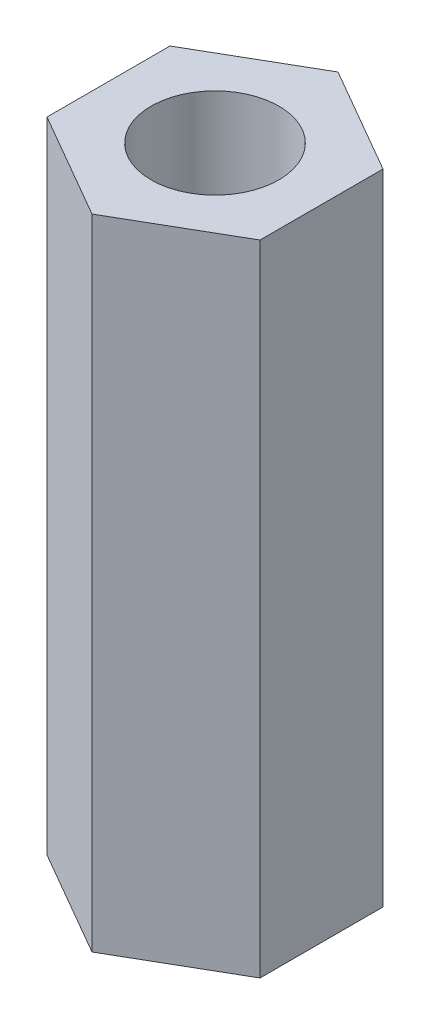
ISO-10303-21;
HEADER;
FILE_DESCRIPTION(('STEP AP214'),'2;1');
FILE_NAME('part.step','',(''),(''),'','','');
FILE_SCHEMA(('AUTOMOTIVE_DESIGN { 1 0 10303 214 1 1 1 1 }'));
ENDSEC;
DATA;
#1=APPLICATION_CONTEXT('core data for automotive mechanical design processes');
#2=APPLICATION_PROTOCOL_DEFINITION('international standard','automotive_design',2000,#1);
#3=PRODUCT_CONTEXT('',#1,'mechanical');
#4=PRODUCT('Part','Part','',(#3));
#5=PRODUCT_RELATED_PRODUCT_CATEGORY('part','',(#4));
#6=PRODUCT_DEFINITION_FORMATION('','',#4);
#7=PRODUCT_DEFINITION_CONTEXT('part definition',#1,'design');
#8=PRODUCT_DEFINITION('design','',#6,#7);
#9=PRODUCT_DEFINITION_SHAPE('','',#8);
#10=(LENGTH_UNIT() NAMED_UNIT(*) SI_UNIT(.MILLI.,.METRE.));
#11=(NAMED_UNIT(*) PLANE_ANGLE_UNIT() SI_UNIT($,.RADIAN.));
#12=(NAMED_UNIT(*) SI_UNIT($,.STERADIAN.) SOLID_ANGLE_UNIT());
#13=UNCERTAINTY_MEASURE_WITH_UNIT(LENGTH_MEASURE(1.E-05),#10,'distance_accuracy_value','');
#14=(GEOMETRIC_REPRESENTATION_CONTEXT(3) GLOBAL_UNCERTAINTY_ASSIGNED_CONTEXT((#13)) GLOBAL_UNIT_ASSIGNED_CONTEXT((#10,
#11,#12)) REPRESENTATION_CONTEXT('',''));
#15=CARTESIAN_POINT('',(0.,0.,0.));
#16=DIRECTION('',(0.,0.,1.));
#17=DIRECTION('',(1.,0.,0.));
#18=AXIS2_PLACEMENT_3D('',#15,#16,#17);
#19=CARTESIAN_POINT('',(0.,15.,0.));
#20=DIRECTION('',(0.,1.,0.));
#21=DIRECTION('',(0.,0.,1.));
#22=AXIS2_PLACEMENT_3D('',#19,#20,#21);
#23=PLANE('',#22);
#24=DIRECTION('',(-0.866025403784439,0.,-0.499999999999999));
#25=VECTOR('',#24,1.);
#26=CARTESIAN_POINT('',(-32.4518092061727,15.,-15.6504060337565));
#27=LINE('',#26,#25);
#28=CARTESIAN_POINT('',(-32.4518092061727,15.,-15.6504060337565));
#29=VERTEX_POINT('',#28);
#30=CARTESIAN_POINT('',(-34.9518092061727,15.,-17.0937817067306));
#31=VERTEX_POINT('',#30);
#32=EDGE_CURVE('E129',#29,#31,#27,.T.);
#33=ORIENTED_EDGE('',*,*,#32,.T.);
#34=DIRECTION('',(-0.866025403784438,0.,0.500000000000001));
#35=VECTOR('',#34,1.);
#36=CARTESIAN_POINT('',(-34.9518092061727,15.,-17.0937817067306));
#37=LINE('',#36,#35);
#38=CARTESIAN_POINT('',(-37.4518092061727,15.,-15.6504060337565));
#39=VERTEX_POINT('',#38);
#40=EDGE_CURVE('E87',#31,#39,#37,.T.);
#41=ORIENTED_EDGE('',*,*,#40,.T.);
#42=DIRECTION('',(0.,0.,1.));
#43=VECTOR('',#42,1.);
#44=CARTESIAN_POINT('',(-37.4518092061727,15.,-15.6504060337565));
#45=LINE('',#44,#43);
#46=CARTESIAN_POINT('',(-37.4518092061727,15.,-12.7636546878084));
#47=VERTEX_POINT('',#46);
#48=EDGE_CURVE('E100',#39,#47,#45,.T.);
#49=ORIENTED_EDGE('',*,*,#48,.T.);
#50=DIRECTION('',(0.866025403784439,0.,0.5));
#51=VECTOR('',#50,1.);
#52=CARTESIAN_POINT('',(-37.4518092061727,15.,-12.7636546878084));
#53=LINE('',#52,#51);
#54=CARTESIAN_POINT('',(-34.9518092061727,15.,-11.3202790148343));
#55=VERTEX_POINT('',#54);
#56=EDGE_CURVE('E94',#47,#55,#53,.T.);
#57=ORIENTED_EDGE('',*,*,#56,.T.);
#58=DIRECTION('',(0.866025403784439,0.,-0.5));
#59=VECTOR('',#58,1.);
#60=CARTESIAN_POINT('',(-34.9518092061727,15.,-11.3202790148343));
#61=LINE('',#60,#59);
#62=CARTESIAN_POINT('',(-32.4518092061727,15.,-12.7636546878084));
#63=VERTEX_POINT('',#62);
#64=EDGE_CURVE('E98',#55,#63,#61,.T.);
#65=ORIENTED_EDGE('',*,*,#64,.T.);
#66=DIRECTION('',(0.,0.,-1.));
#67=VECTOR('',#66,1.);
#68=CARTESIAN_POINT('',(-32.4518092061727,15.,-12.7636546878084));
#69=LINE('',#68,#67);
#70=EDGE_CURVE('E50',#63,#29,#69,.T.);
#71=ORIENTED_EDGE('',*,*,#70,.T.);
#72=EDGE_LOOP('',(#33,#41,#49,#57,#65,#71));
#73=FACE_BOUND('',#72,.T.);
#74=CARTESIAN_POINT('',(-34.9518092061727,15.,-14.2070303607825));
#75=DIRECTION('',(0.,1.,0.));
#76=DIRECTION('',(0.,0.,1.));
#77=AXIS2_PLACEMENT_3D('',#74,#75,#76);
#78=CIRCLE('',#77,1.5);
#79=CARTESIAN_POINT('',(-34.9518092061727,15.,-12.7070303607825));
#80=VERTEX_POINT('',#79);
#81=EDGE_CURVE('E122',#80,#80,#78,.T.);
#82=ORIENTED_EDGE('',*,*,#81,.F.);
#83=EDGE_LOOP('',(#82));
#84=FACE_BOUND('',#83,.T.);
#85=ADVANCED_FACE('F33',(#73,#84),#23,.T.);
#86=CARTESIAN_POINT('',(0.,0.,0.));
#87=DIRECTION('',(0.,1.,0.));
#88=DIRECTION('',(0.,0.,1.));
#89=AXIS2_PLACEMENT_3D('',#86,#87,#88);
#90=PLANE('',#89);
#91=DIRECTION('',(-0.866025403784439,0.,-0.499999999999999));
#92=VECTOR('',#91,1.);
#93=CARTESIAN_POINT('',(-32.4518092061727,0.,-15.6504060337565));
#94=LINE('',#93,#92);
#95=CARTESIAN_POINT('',(-32.4518092061727,0.,-15.6504060337565));
#96=VERTEX_POINT('',#95);
#97=CARTESIAN_POINT('',(-34.9518092061727,0.,-17.0937817067306));
#98=VERTEX_POINT('',#97);
#99=EDGE_CURVE('E118',#96,#98,#94,.T.);
#100=ORIENTED_EDGE('',*,*,#99,.F.);
#101=DIRECTION('',(0.,0.,-1.));
#102=VECTOR('',#101,1.);
#103=CARTESIAN_POINT('',(-32.4518092061727,0.,-12.7636546878084));
#104=LINE('',#103,#102);
#105=CARTESIAN_POINT('',(-32.4518092061727,0.,-12.7636546878084));
#106=VERTEX_POINT('',#105);
#107=EDGE_CURVE('E79',#106,#96,#104,.T.);
#108=ORIENTED_EDGE('',*,*,#107,.F.);
#109=DIRECTION('',(0.866025403784439,0.,-0.5));
#110=VECTOR('',#109,1.);
#111=CARTESIAN_POINT('',(-34.9518092061727,0.,-11.3202790148343));
#112=LINE('',#111,#110);
#113=CARTESIAN_POINT('',(-34.9518092061727,0.,-11.3202790148343));
#114=VERTEX_POINT('',#113);
#115=EDGE_CURVE('E73',#114,#106,#112,.T.);
#116=ORIENTED_EDGE('',*,*,#115,.F.);
#117=DIRECTION('',(0.866025403784439,0.,0.5));
#118=VECTOR('',#117,1.);
#119=CARTESIAN_POINT('',(-37.4518092061727,0.,-12.7636546878084));
#120=LINE('',#119,#118);
#121=CARTESIAN_POINT('',(-37.4518092061727,0.,-12.7636546878084));
#122=VERTEX_POINT('',#121);
#123=EDGE_CURVE('E108',#122,#114,#120,.T.);
#124=ORIENTED_EDGE('',*,*,#123,.F.);
#125=DIRECTION('',(0.,0.,1.));
#126=VECTOR('',#125,1.);
#127=CARTESIAN_POINT('',(-37.4518092061727,0.,-15.6504060337565));
#128=LINE('',#127,#126);
#129=CARTESIAN_POINT('',(-37.4518092061727,0.,-15.6504060337565));
#130=VERTEX_POINT('',#129);
#131=EDGE_CURVE('E124',#130,#122,#128,.T.);
#132=ORIENTED_EDGE('',*,*,#131,.F.);
#133=DIRECTION('',(-0.866025403784438,0.,0.500000000000001));
#134=VECTOR('',#133,1.);
#135=CARTESIAN_POINT('',(-34.9518092061727,0.,-17.0937817067306));
#136=LINE('',#135,#134);
#137=EDGE_CURVE('E121',#98,#130,#136,.T.);
#138=ORIENTED_EDGE('',*,*,#137,.F.);
#139=EDGE_LOOP('',(#100,#108,#116,#124,#132,#138));
#140=FACE_BOUND('',#139,.T.);
#141=CARTESIAN_POINT('',(-34.9518092061727,0.,-14.2070303607825));
#142=DIRECTION('',(0.,1.,0.));
#143=DIRECTION('',(0.,0.,1.));
#144=AXIS2_PLACEMENT_3D('',#141,#142,#143);
#145=CIRCLE('',#144,1.5);
#146=CARTESIAN_POINT('',(-34.9518092061727,0.,-12.7070303607825));
#147=VERTEX_POINT('',#146);
#148=EDGE_CURVE('E222',#147,#147,#145,.T.);
#149=ORIENTED_EDGE('',*,*,#148,.T.);
#150=EDGE_LOOP('',(#149));
#151=FACE_BOUND('',#150,.T.);
#152=ADVANCED_FACE('F138',(#140,#151),#90,.F.);
#153=CARTESIAN_POINT('',(-32.4518092061727,15.,-15.6504060337565));
#154=DIRECTION('',(-0.499999999999999,0.,0.866025403784439));
#155=DIRECTION('',(0.866025403784439,0.,0.499999999999999));
#156=AXIS2_PLACEMENT_3D('',#153,#154,#155);
#157=PLANE('',#156);
#158=ORIENTED_EDGE('',*,*,#99,.T.);
#159=DIRECTION('',(0.,-1.,0.));
#160=VECTOR('',#159,1.);
#161=CARTESIAN_POINT('',(-34.9518092061727,15.,-17.0937817067306));
#162=LINE('',#161,#160);
#163=EDGE_CURVE('E11',#31,#98,#162,.T.);
#164=ORIENTED_EDGE('',*,*,#163,.F.);
#165=ORIENTED_EDGE('',*,*,#32,.F.);
#166=DIRECTION('',(0.,-1.,0.));
#167=VECTOR('',#166,1.);
#168=CARTESIAN_POINT('',(-32.4518092061727,15.,-15.6504060337565));
#169=LINE('',#168,#167);
#170=EDGE_CURVE('E114',#29,#96,#169,.T.);
#171=ORIENTED_EDGE('',*,*,#170,.T.);
#172=EDGE_LOOP('',(#158,#164,#165,#171));
#173=FACE_BOUND('',#172,.T.);
#174=ADVANCED_FACE('F35',(#173),#157,.F.);
#175=CARTESIAN_POINT('',(-34.9518092061727,15.,-17.0937817067306));
#176=DIRECTION('',(0.500000000000001,0.,0.866025403784438));
#177=DIRECTION('',(0.866025403784438,0.,-0.500000000000001));
#178=AXIS2_PLACEMENT_3D('',#175,#176,#177);
#179=PLANE('',#178);
#180=ORIENTED_EDGE('',*,*,#137,.T.);
#181=DIRECTION('',(0.,-1.,0.));
#182=VECTOR('',#181,1.);
#183=CARTESIAN_POINT('',(-37.4518092061727,15.,-15.6504060337565));
#184=LINE('',#183,#182);
#185=EDGE_CURVE('E42',#39,#130,#184,.T.);
#186=ORIENTED_EDGE('',*,*,#185,.F.);
#187=ORIENTED_EDGE('',*,*,#40,.F.);
#188=ORIENTED_EDGE('',*,*,#163,.T.);
#189=EDGE_LOOP('',(#180,#186,#187,#188));
#190=FACE_BOUND('',#189,.T.);
#191=ADVANCED_FACE('F163',(#190),#179,.F.);
#192=CARTESIAN_POINT('',(-37.4518092061727,15.,-15.6504060337565));
#193=DIRECTION('',(1.,0.,0.));
#194=DIRECTION('',(0.,0.,-1.));
#195=AXIS2_PLACEMENT_3D('',#192,#193,#194);
#196=PLANE('',#195);
#197=ORIENTED_EDGE('',*,*,#131,.T.);
#198=DIRECTION('',(0.,-1.,0.));
#199=VECTOR('',#198,1.);
#200=CARTESIAN_POINT('',(-37.4518092061727,15.,-12.7636546878084));
#201=LINE('',#200,#199);
#202=EDGE_CURVE('E109',#47,#122,#201,.T.);
#203=ORIENTED_EDGE('',*,*,#202,.F.);
#204=ORIENTED_EDGE('',*,*,#48,.F.);
#205=ORIENTED_EDGE('',*,*,#185,.T.);
#206=EDGE_LOOP('',(#197,#203,#204,#205));
#207=FACE_BOUND('',#206,.T.);
#208=ADVANCED_FACE('F135',(#207),#196,.F.);
#209=CARTESIAN_POINT('',(-37.4518092061727,15.,-12.7636546878084));
#210=DIRECTION('',(0.5,0.,-0.866025403784439));
#211=DIRECTION('',(-0.866025403784439,0.,-0.5));
#212=AXIS2_PLACEMENT_3D('',#209,#210,#211);
#213=PLANE('',#212);
#214=ORIENTED_EDGE('',*,*,#123,.T.);
#215=DIRECTION('',(0.,-1.,0.));
#216=VECTOR('',#215,1.);
#217=CARTESIAN_POINT('',(-34.9518092061727,15.,-11.3202790148343));
#218=LINE('',#217,#216);
#219=EDGE_CURVE('E105',#55,#114,#218,.T.);
#220=ORIENTED_EDGE('',*,*,#219,.F.);
#221=ORIENTED_EDGE('',*,*,#56,.F.);
#222=ORIENTED_EDGE('',*,*,#202,.T.);
#223=EDGE_LOOP('',(#214,#220,#221,#222));
#224=FACE_BOUND('',#223,.T.);
#225=ADVANCED_FACE('F106',(#224),#213,.F.);
#226=CARTESIAN_POINT('',(-34.9518092061727,15.,-11.3202790148343));
#227=DIRECTION('',(-0.5,0.,-0.866025403784439));
#228=DIRECTION('',(-0.866025403784439,0.,0.5));
#229=AXIS2_PLACEMENT_3D('',#226,#227,#228);
#230=PLANE('',#229);
#231=ORIENTED_EDGE('',*,*,#115,.T.);
#232=DIRECTION('',(0.,-1.,0.));
#233=VECTOR('',#232,1.);
#234=CARTESIAN_POINT('',(-32.4518092061727,15.,-12.7636546878084));
#235=LINE('',#234,#233);
#236=EDGE_CURVE('E110',#63,#106,#235,.T.);
#237=ORIENTED_EDGE('',*,*,#236,.F.);
#238=ORIENTED_EDGE('',*,*,#64,.F.);
#239=ORIENTED_EDGE('',*,*,#219,.T.);
#240=EDGE_LOOP('',(#231,#237,#238,#239));
#241=FACE_BOUND('',#240,.T.);
#242=ADVANCED_FACE('F112',(#241),#230,.F.);
#243=CARTESIAN_POINT('',(-32.4518092061727,15.,-12.7636546878084));
#244=DIRECTION('',(-1.,0.,0.));
#245=DIRECTION('',(0.,0.,1.));
#246=AXIS2_PLACEMENT_3D('',#243,#244,#245);
#247=PLANE('',#246);
#248=ORIENTED_EDGE('',*,*,#107,.T.);
#249=ORIENTED_EDGE('',*,*,#170,.F.);
#250=ORIENTED_EDGE('',*,*,#70,.F.);
#251=ORIENTED_EDGE('',*,*,#236,.T.);
#252=EDGE_LOOP('',(#248,#249,#250,#251));
#253=FACE_BOUND('',#252,.T.);
#254=ADVANCED_FACE('F143',(#253),#247,.F.);
#255=CARTESIAN_POINT('',(-34.9518092061727,15.,-14.2070303607825));
#256=DIRECTION('',(0.,-1.,0.));
#257=DIRECTION('',(0.,0.,-1.));
#258=AXIS2_PLACEMENT_3D('',#255,#256,#257);
#259=CYLINDRICAL_SURFACE('',#258,1.5);
#260=ORIENTED_EDGE('',*,*,#81,.T.);
#261=EDGE_LOOP('',(#260));
#262=FACE_BOUND('',#261,.T.);
#263=ORIENTED_EDGE('',*,*,#148,.F.);
#264=EDGE_LOOP('',(#263));
#265=FACE_BOUND('',#264,.T.);
#266=ADVANCED_FACE('F145',(#262,#265),#259,.F.);
#267=CLOSED_SHELL('',(#85,#152,#174,#191,#208,#225,#242,#254,#266));
#268=MANIFOLD_SOLID_BREP('B2',#267);
#269=ADVANCED_BREP_SHAPE_REPRESENTATION('',(#18,#268),#14);
#270=SHAPE_DEFINITION_REPRESENTATION(#9,#269);
ENDSEC;
END-ISO-10303-21;
